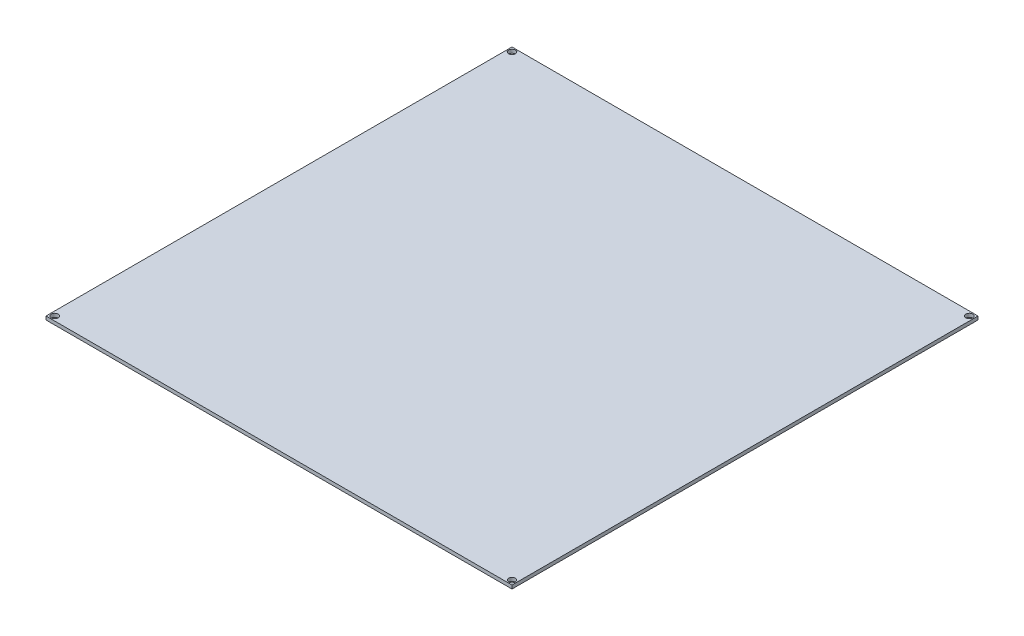
ISO-10303-21;
HEADER;
FILE_DESCRIPTION(('STEP AP214'),'2;1');
FILE_NAME('part.step','',(''),(''),'','','');
FILE_SCHEMA(('AUTOMOTIVE_DESIGN { 1 0 10303 214 1 1 1 1 }'));
ENDSEC;
DATA;
#1=APPLICATION_CONTEXT('core data for automotive mechanical design processes');
#2=APPLICATION_PROTOCOL_DEFINITION('international standard','automotive_design',2000,#1);
#3=PRODUCT_CONTEXT('',#1,'mechanical');
#4=PRODUCT('Part','Part','',(#3));
#5=PRODUCT_RELATED_PRODUCT_CATEGORY('part','',(#4));
#6=PRODUCT_DEFINITION_FORMATION('','',#4);
#7=PRODUCT_DEFINITION_CONTEXT('part definition',#1,'design');
#8=PRODUCT_DEFINITION('design','',#6,#7);
#9=PRODUCT_DEFINITION_SHAPE('','',#8);
#10=(LENGTH_UNIT() NAMED_UNIT(*) SI_UNIT(.MILLI.,.METRE.));
#11=(NAMED_UNIT(*) PLANE_ANGLE_UNIT() SI_UNIT($,.RADIAN.));
#12=(NAMED_UNIT(*) SI_UNIT($,.STERADIAN.) SOLID_ANGLE_UNIT());
#13=UNCERTAINTY_MEASURE_WITH_UNIT(LENGTH_MEASURE(1.E-05),#10,'distance_accuracy_value','');
#14=(GEOMETRIC_REPRESENTATION_CONTEXT(3) GLOBAL_UNCERTAINTY_ASSIGNED_CONTEXT((#13)) GLOBAL_UNIT_ASSIGNED_CONTEXT((#10,
#11,#12)) REPRESENTATION_CONTEXT('',''));
#15=CARTESIAN_POINT('',(0.,0.,0.));
#16=DIRECTION('',(0.,0.,1.));
#17=DIRECTION('',(1.,0.,0.));
#18=AXIS2_PLACEMENT_3D('',#15,#16,#17);
#19=CARTESIAN_POINT('',(107.,1.6,-107.));
#20=DIRECTION('',(0.,0.,1.));
#21=DIRECTION('',(1.,0.,0.));
#22=AXIS2_PLACEMENT_3D('',#19,#20,#21);
#23=PLANE('',#22);
#24=DIRECTION('',(-1.,0.,0.));
#25=VECTOR('',#24,1.);
#26=CARTESIAN_POINT('',(107.,0.,-107.));
#27=LINE('',#26,#25);
#28=CARTESIAN_POINT('',(107.,0.,-107.));
#29=VERTEX_POINT('',#28);
#30=CARTESIAN_POINT('',(-107.,0.,-107.));
#31=VERTEX_POINT('',#30);
#32=EDGE_CURVE('E106',#29,#31,#27,.T.);
#33=ORIENTED_EDGE('',*,*,#32,.T.);
#34=DIRECTION('',(0.,-1.,0.));
#35=VECTOR('',#34,1.);
#36=CARTESIAN_POINT('',(-107.,1.6,-107.));
#37=LINE('',#36,#35);
#38=CARTESIAN_POINT('',(-107.,1.6,-107.));
#39=VERTEX_POINT('',#38);
#40=EDGE_CURVE('E11',#39,#31,#37,.T.);
#41=ORIENTED_EDGE('',*,*,#40,.F.);
#42=DIRECTION('',(-1.,0.,0.));
#43=VECTOR('',#42,1.);
#44=CARTESIAN_POINT('',(107.,1.6,-107.));
#45=LINE('',#44,#43);
#46=CARTESIAN_POINT('',(107.,1.6,-107.));
#47=VERTEX_POINT('',#46);
#48=EDGE_CURVE('E91',#47,#39,#45,.T.);
#49=ORIENTED_EDGE('',*,*,#48,.F.);
#50=DIRECTION('',(0.,-1.,0.));
#51=VECTOR('',#50,1.);
#52=CARTESIAN_POINT('',(107.,1.6,-107.));
#53=LINE('',#52,#51);
#54=EDGE_CURVE('E58',#47,#29,#53,.T.);
#55=ORIENTED_EDGE('',*,*,#54,.T.);
#56=EDGE_LOOP('',(#33,#41,#49,#55));
#57=FACE_BOUND('',#56,.T.);
#58=ADVANCED_FACE('F40',(#57),#23,.F.);
#59=CARTESIAN_POINT('',(-107.,1.6,-107.));
#60=DIRECTION('',(1.,0.,0.));
#61=DIRECTION('',(0.,0.,-1.));
#62=AXIS2_PLACEMENT_3D('',#59,#60,#61);
#63=PLANE('',#62);
#64=DIRECTION('',(0.,0.,1.));
#65=VECTOR('',#64,1.);
#66=CARTESIAN_POINT('',(-107.,0.,-107.));
#67=LINE('',#66,#65);
#68=CARTESIAN_POINT('',(-107.,0.,107.));
#69=VERTEX_POINT('',#68);
#70=EDGE_CURVE('E96',#31,#69,#67,.T.);
#71=ORIENTED_EDGE('',*,*,#70,.T.);
#72=DIRECTION('',(0.,-1.,0.));
#73=VECTOR('',#72,1.);
#74=CARTESIAN_POINT('',(-107.,1.6,107.));
#75=LINE('',#74,#73);
#76=CARTESIAN_POINT('',(-107.,1.6,107.));
#77=VERTEX_POINT('',#76);
#78=EDGE_CURVE('E48',#77,#69,#75,.T.);
#79=ORIENTED_EDGE('',*,*,#78,.F.);
#80=DIRECTION('',(0.,0.,1.));
#81=VECTOR('',#80,1.);
#82=CARTESIAN_POINT('',(-107.,1.6,-107.));
#83=LINE('',#82,#81);
#84=EDGE_CURVE('E83',#39,#77,#83,.T.);
#85=ORIENTED_EDGE('',*,*,#84,.F.);
#86=ORIENTED_EDGE('',*,*,#40,.T.);
#87=EDGE_LOOP('',(#71,#79,#85,#86));
#88=FACE_BOUND('',#87,.T.);
#89=ADVANCED_FACE('F95',(#88),#63,.F.);
#90=CARTESIAN_POINT('',(107.,1.6,107.));
#91=DIRECTION('',(0.,0.,1.));
#92=DIRECTION('',(1.,0.,0.));
#93=AXIS2_PLACEMENT_3D('',#90,#91,#92);
#94=PLANE('',#93);
#95=DIRECTION('',(-1.,0.,0.));
#96=VECTOR('',#95,1.);
#97=CARTESIAN_POINT('',(107.,0.,107.));
#98=LINE('',#97,#96);
#99=CARTESIAN_POINT('',(107.,0.,107.));
#100=VERTEX_POINT('',#99);
#101=EDGE_CURVE('E111',#100,#69,#98,.T.);
#102=ORIENTED_EDGE('',*,*,#101,.F.);
#103=DIRECTION('',(0.,-1.,0.));
#104=VECTOR('',#103,1.);
#105=CARTESIAN_POINT('',(107.,1.6,107.));
#106=LINE('',#105,#104);
#107=CARTESIAN_POINT('',(107.,1.6,107.));
#108=VERTEX_POINT('',#107);
#109=EDGE_CURVE('E72',#108,#100,#106,.T.);
#110=ORIENTED_EDGE('',*,*,#109,.F.);
#111=DIRECTION('',(-1.,0.,0.));
#112=VECTOR('',#111,1.);
#113=CARTESIAN_POINT('',(107.,1.6,107.));
#114=LINE('',#113,#112);
#115=EDGE_CURVE('E90',#108,#77,#114,.T.);
#116=ORIENTED_EDGE('',*,*,#115,.T.);
#117=ORIENTED_EDGE('',*,*,#78,.T.);
#118=EDGE_LOOP('',(#102,#110,#116,#117));
#119=FACE_BOUND('',#118,.T.);
#120=ADVANCED_FACE('F99',(#119),#94,.T.);
#121=CARTESIAN_POINT('',(107.,1.6,-107.));
#122=DIRECTION('',(1.,0.,0.));
#123=DIRECTION('',(0.,0.,-1.));
#124=AXIS2_PLACEMENT_3D('',#121,#122,#123);
#125=PLANE('',#124);
#126=DIRECTION('',(0.,0.,1.));
#127=VECTOR('',#126,1.);
#128=CARTESIAN_POINT('',(107.,0.,-107.));
#129=LINE('',#128,#127);
#130=EDGE_CURVE('E113',#29,#100,#129,.T.);
#131=ORIENTED_EDGE('',*,*,#130,.F.);
#132=ORIENTED_EDGE('',*,*,#54,.F.);
#133=DIRECTION('',(0.,0.,1.));
#134=VECTOR('',#133,1.);
#135=CARTESIAN_POINT('',(107.,1.6,-107.));
#136=LINE('',#135,#134);
#137=EDGE_CURVE('E100',#47,#108,#136,.T.);
#138=ORIENTED_EDGE('',*,*,#137,.T.);
#139=ORIENTED_EDGE('',*,*,#109,.T.);
#140=EDGE_LOOP('',(#131,#132,#138,#139));
#141=FACE_BOUND('',#140,.T.);
#142=ADVANCED_FACE('F153',(#141),#125,.T.);
#143=CARTESIAN_POINT('',(0.,1.6,0.));
#144=DIRECTION('',(0.,1.,0.));
#145=DIRECTION('',(0.,0.,1.));
#146=AXIS2_PLACEMENT_3D('',#143,#144,#145);
#147=PLANE('',#146);
#148=CARTESIAN_POINT('',(-105.,1.6,-105.));
#149=DIRECTION('',(0.,1.,0.));
#150=DIRECTION('',(0.,0.,1.));
#151=AXIS2_PLACEMENT_3D('',#148,#149,#150);
#152=CIRCLE('',#151,1.55);
#153=CARTESIAN_POINT('',(-105.,1.6,-103.45));
#154=VERTEX_POINT('',#153);
#155=EDGE_CURVE('E143',#154,#154,#152,.T.);
#156=ORIENTED_EDGE('',*,*,#155,.F.);
#157=EDGE_LOOP('',(#156));
#158=FACE_BOUND('',#157,.T.);
#159=CARTESIAN_POINT('',(105.,1.6,-105.));
#160=DIRECTION('',(0.,1.,0.));
#161=DIRECTION('',(0.,0.,1.));
#162=AXIS2_PLACEMENT_3D('',#159,#160,#161);
#163=CIRCLE('',#162,1.55);
#164=CARTESIAN_POINT('',(105.,1.6,-103.45));
#165=VERTEX_POINT('',#164);
#166=EDGE_CURVE('E124',#165,#165,#163,.T.);
#167=ORIENTED_EDGE('',*,*,#166,.F.);
#168=EDGE_LOOP('',(#167));
#169=FACE_BOUND('',#168,.T.);
#170=CARTESIAN_POINT('',(105.,1.6,105.000000000002));
#171=DIRECTION('',(0.,1.,0.));
#172=DIRECTION('',(0.,0.,1.));
#173=AXIS2_PLACEMENT_3D('',#170,#171,#172);
#174=CIRCLE('',#173,1.55);
#175=CARTESIAN_POINT('',(105.,1.6,106.550000000002));
#176=VERTEX_POINT('',#175);
#177=EDGE_CURVE('E123',#176,#176,#174,.T.);
#178=ORIENTED_EDGE('',*,*,#177,.F.);
#179=EDGE_LOOP('',(#178));
#180=FACE_BOUND('',#179,.T.);
#181=CARTESIAN_POINT('',(-104.999999999998,1.6,105.));
#182=DIRECTION('',(0.,1.,0.));
#183=DIRECTION('',(0.,0.,1.));
#184=AXIS2_PLACEMENT_3D('',#181,#182,#183);
#185=CIRCLE('',#184,1.55);
#186=CARTESIAN_POINT('',(-104.999999999998,1.6,106.55));
#187=VERTEX_POINT('',#186);
#188=EDGE_CURVE('E133',#187,#187,#185,.T.);
#189=ORIENTED_EDGE('',*,*,#188,.F.);
#190=EDGE_LOOP('',(#189));
#191=FACE_BOUND('',#190,.T.);
#192=ORIENTED_EDGE('',*,*,#48,.T.);
#193=ORIENTED_EDGE('',*,*,#84,.T.);
#194=ORIENTED_EDGE('',*,*,#115,.F.);
#195=ORIENTED_EDGE('',*,*,#137,.F.);
#196=EDGE_LOOP('',(#192,#193,#194,#195));
#197=FACE_BOUND('',#196,.T.);
#198=ADVANCED_FACE('F87',(#158,#169,#180,#191,#197),#147,.T.);
#199=CARTESIAN_POINT('',(0.,0.,0.));
#200=DIRECTION('',(0.,1.,0.));
#201=DIRECTION('',(0.,0.,1.));
#202=AXIS2_PLACEMENT_3D('',#199,#200,#201);
#203=PLANE('',#202);
#204=CARTESIAN_POINT('',(-105.,0.,-105.));
#205=DIRECTION('',(0.,1.,0.));
#206=DIRECTION('',(0.,0.,1.));
#207=AXIS2_PLACEMENT_3D('',#204,#205,#206);
#208=CIRCLE('',#207,1.55);
#209=CARTESIAN_POINT('',(-105.,0.,-103.45));
#210=VERTEX_POINT('',#209);
#211=EDGE_CURVE('E127',#210,#210,#208,.T.);
#212=ORIENTED_EDGE('',*,*,#211,.T.);
#213=EDGE_LOOP('',(#212));
#214=FACE_BOUND('',#213,.T.);
#215=CARTESIAN_POINT('',(105.,0.,-105.));
#216=DIRECTION('',(0.,1.,0.));
#217=DIRECTION('',(0.,0.,1.));
#218=AXIS2_PLACEMENT_3D('',#215,#216,#217);
#219=CIRCLE('',#218,1.55);
#220=CARTESIAN_POINT('',(105.,0.,-103.45));
#221=VERTEX_POINT('',#220);
#222=EDGE_CURVE('E120',#221,#221,#219,.T.);
#223=ORIENTED_EDGE('',*,*,#222,.T.);
#224=EDGE_LOOP('',(#223));
#225=FACE_BOUND('',#224,.T.);
#226=CARTESIAN_POINT('',(105.,0.,105.000000000002));
#227=DIRECTION('',(0.,1.,0.));
#228=DIRECTION('',(0.,0.,1.));
#229=AXIS2_PLACEMENT_3D('',#226,#227,#228);
#230=CIRCLE('',#229,1.55);
#231=CARTESIAN_POINT('',(105.,0.,106.550000000002));
#232=VERTEX_POINT('',#231);
#233=EDGE_CURVE('E136',#232,#232,#230,.T.);
#234=ORIENTED_EDGE('',*,*,#233,.T.);
#235=EDGE_LOOP('',(#234));
#236=FACE_BOUND('',#235,.T.);
#237=CARTESIAN_POINT('',(-104.999999999998,0.,105.));
#238=DIRECTION('',(0.,1.,0.));
#239=DIRECTION('',(0.,0.,1.));
#240=AXIS2_PLACEMENT_3D('',#237,#238,#239);
#241=CIRCLE('',#240,1.55);
#242=CARTESIAN_POINT('',(-104.999999999998,0.,106.55));
#243=VERTEX_POINT('',#242);
#244=EDGE_CURVE('E109',#243,#243,#241,.T.);
#245=ORIENTED_EDGE('',*,*,#244,.T.);
#246=EDGE_LOOP('',(#245));
#247=FACE_BOUND('',#246,.T.);
#248=ORIENTED_EDGE('',*,*,#32,.F.);
#249=ORIENTED_EDGE('',*,*,#130,.T.);
#250=ORIENTED_EDGE('',*,*,#101,.T.);
#251=ORIENTED_EDGE('',*,*,#70,.F.);
#252=EDGE_LOOP('',(#248,#249,#250,#251));
#253=FACE_BOUND('',#252,.T.);
#254=ADVANCED_FACE('F152',(#214,#225,#236,#247,#253),#203,.F.);
#255=CARTESIAN_POINT('',(-104.999999999998,1.6,105.));
#256=DIRECTION('',(0.,1.,0.));
#257=DIRECTION('',(0.,0.,1.));
#258=AXIS2_PLACEMENT_3D('',#255,#256,#257);
#259=CYLINDRICAL_SURFACE('',#258,1.55);
#260=ORIENTED_EDGE('',*,*,#188,.T.);
#261=EDGE_LOOP('',(#260));
#262=FACE_BOUND('',#261,.T.);
#263=ORIENTED_EDGE('',*,*,#244,.F.);
#264=EDGE_LOOP('',(#263));
#265=FACE_BOUND('',#264,.T.);
#266=ADVANCED_FACE('F161',(#262,#265),#259,.F.);
#267=CARTESIAN_POINT('',(105.,1.6,105.000000000002));
#268=DIRECTION('',(0.,1.,0.));
#269=DIRECTION('',(0.,0.,1.));
#270=AXIS2_PLACEMENT_3D('',#267,#268,#269);
#271=CYLINDRICAL_SURFACE('',#270,1.55);
#272=ORIENTED_EDGE('',*,*,#177,.T.);
#273=EDGE_LOOP('',(#272));
#274=FACE_BOUND('',#273,.T.);
#275=ORIENTED_EDGE('',*,*,#233,.F.);
#276=EDGE_LOOP('',(#275));
#277=FACE_BOUND('',#276,.T.);
#278=ADVANCED_FACE('F164',(#274,#277),#271,.F.);
#279=CARTESIAN_POINT('',(105.,1.6,-105.));
#280=DIRECTION('',(0.,1.,0.));
#281=DIRECTION('',(0.,0.,1.));
#282=AXIS2_PLACEMENT_3D('',#279,#280,#281);
#283=CYLINDRICAL_SURFACE('',#282,1.55);
#284=ORIENTED_EDGE('',*,*,#166,.T.);
#285=EDGE_LOOP('',(#284));
#286=FACE_BOUND('',#285,.T.);
#287=ORIENTED_EDGE('',*,*,#222,.F.);
#288=EDGE_LOOP('',(#287));
#289=FACE_BOUND('',#288,.T.);
#290=ADVANCED_FACE('F219',(#286,#289),#283,.F.);
#291=CARTESIAN_POINT('',(-105.,1.6,-105.));
#292=DIRECTION('',(0.,1.,0.));
#293=DIRECTION('',(0.,0.,1.));
#294=AXIS2_PLACEMENT_3D('',#291,#292,#293);
#295=CYLINDRICAL_SURFACE('',#294,1.55);
#296=ORIENTED_EDGE('',*,*,#155,.T.);
#297=EDGE_LOOP('',(#296));
#298=FACE_BOUND('',#297,.T.);
#299=ORIENTED_EDGE('',*,*,#211,.F.);
#300=EDGE_LOOP('',(#299));
#301=FACE_BOUND('',#300,.T.);
#302=ADVANCED_FACE('F147',(#298,#301),#295,.F.);
#303=CLOSED_SHELL('',(#58,#89,#120,#142,#198,#254,#266,#278,#290,#302));
#304=MANIFOLD_SOLID_BREP('B2',#303);
#305=ADVANCED_BREP_SHAPE_REPRESENTATION('',(#18,#304),#14);
#306=SHAPE_DEFINITION_REPRESENTATION(#9,#305);
ENDSEC;
END-ISO-10303-21;
